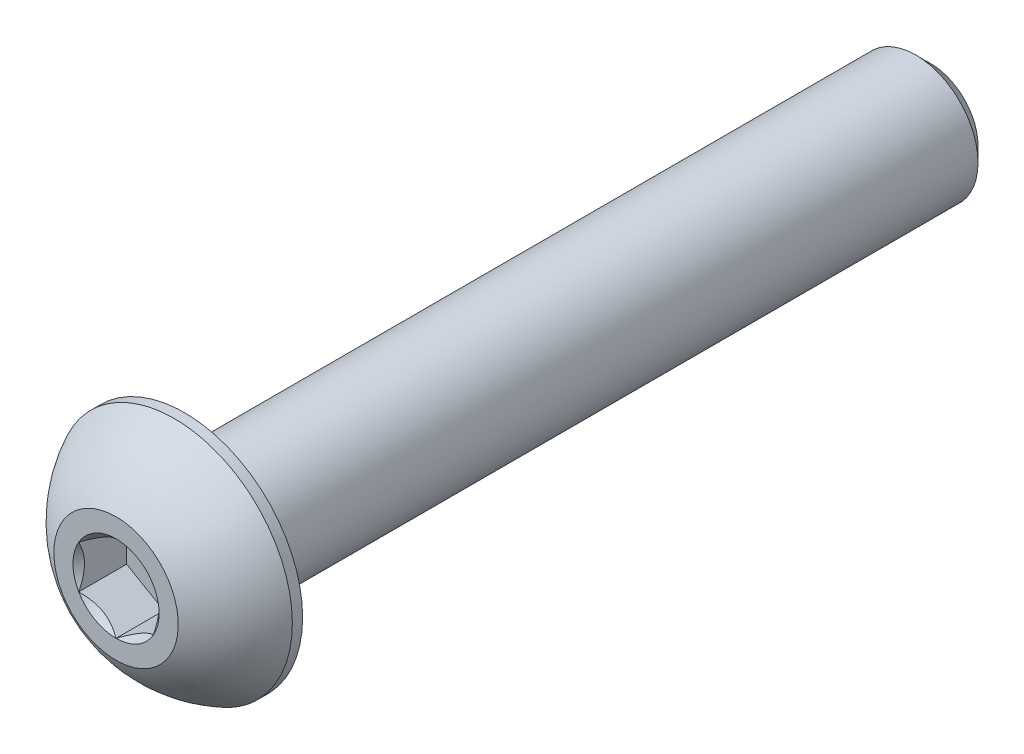
ISO-10303-21;
HEADER;
FILE_DESCRIPTION(('STEP AP214'),'2;1');
FILE_NAME('part.step','',(''),(''),'','','');
FILE_SCHEMA(('AUTOMOTIVE_DESIGN { 1 0 10303 214 1 1 1 1 }'));
ENDSEC;
DATA;
#1=APPLICATION_CONTEXT('core data for automotive mechanical design processes');
#2=APPLICATION_PROTOCOL_DEFINITION('international standard','automotive_design',2000,#1);
#3=PRODUCT_CONTEXT('',#1,'mechanical');
#4=PRODUCT('Part','Part','',(#3));
#5=PRODUCT_RELATED_PRODUCT_CATEGORY('part','',(#4));
#6=PRODUCT_DEFINITION_FORMATION('','',#4);
#7=PRODUCT_DEFINITION_CONTEXT('part definition',#1,'design');
#8=PRODUCT_DEFINITION('design','',#6,#7);
#9=PRODUCT_DEFINITION_SHAPE('','',#8);
#10=(LENGTH_UNIT() NAMED_UNIT(*) SI_UNIT(.MILLI.,.METRE.));
#11=(NAMED_UNIT(*) PLANE_ANGLE_UNIT() SI_UNIT($,.RADIAN.));
#12=(NAMED_UNIT(*) SI_UNIT($,.STERADIAN.) SOLID_ANGLE_UNIT());
#13=UNCERTAINTY_MEASURE_WITH_UNIT(LENGTH_MEASURE(1.E-05),#10,'distance_accuracy_value','');
#14=(GEOMETRIC_REPRESENTATION_CONTEXT(3) GLOBAL_UNCERTAINTY_ASSIGNED_CONTEXT((#13)) GLOBAL_UNIT_ASSIGNED_CONTEXT((#10,
#11,#12)) REPRESENTATION_CONTEXT('',''));
#15=CARTESIAN_POINT('',(0.,0.,0.));
#16=DIRECTION('',(0.,0.,1.));
#17=DIRECTION('',(1.,0.,0.));
#18=AXIS2_PLACEMENT_3D('',#15,#16,#17);
#19=CARTESIAN_POINT('',(1.5,-0.866025403784438,-1.925));
#20=DIRECTION('',(0.,0.,1.));
#21=DIRECTION('',(1.,0.,0.));
#22=AXIS2_PLACEMENT_3D('',#19,#20,#21);
#23=PLANE('',#22);
#24=DIRECTION('',(0.,1.,0.));
#25=VECTOR('',#24,1.);
#26=CARTESIAN_POINT('',(-1.5,0.866025403784438,-1.925));
#27=LINE('',#26,#25);
#28=CARTESIAN_POINT('',(-1.5,0.866025403784439,-1.925));
#29=VERTEX_POINT('',#28);
#30=CARTESIAN_POINT('',(-1.5,-0.866025403784439,-1.925));
#31=VERTEX_POINT('',#30);
#32=EDGE_CURVE('E67',#29,#31,#27,.F.);
#33=ORIENTED_EDGE('',*,*,#32,.T.);
#34=DIRECTION('',(0.866025403784439,-0.5,0.));
#35=VECTOR('',#34,1.);
#36=CARTESIAN_POINT('',(-1.5,-0.866025403784439,-1.925));
#37=LINE('',#36,#35);
#38=CARTESIAN_POINT('',(0.,-1.73205080756888,-1.925));
#39=VERTEX_POINT('',#38);
#40=EDGE_CURVE('E81',#31,#39,#37,.T.);
#41=ORIENTED_EDGE('',*,*,#40,.T.);
#42=DIRECTION('',(0.866025403784438,0.5,0.));
#43=VECTOR('',#42,1.);
#44=CARTESIAN_POINT('',(0.,-1.73205080756888,-1.925));
#45=LINE('',#44,#43);
#46=CARTESIAN_POINT('',(1.5,-0.866025403784439,-1.925));
#47=VERTEX_POINT('',#46);
#48=EDGE_CURVE('E84',#39,#47,#45,.T.);
#49=ORIENTED_EDGE('',*,*,#48,.T.);
#50=DIRECTION('',(0.,1.,0.));
#51=VECTOR('',#50,1.);
#52=CARTESIAN_POINT('',(1.5,-0.866025403784438,-1.925));
#53=LINE('',#52,#51);
#54=CARTESIAN_POINT('',(1.5,0.866025403784439,-1.925));
#55=VERTEX_POINT('',#54);
#56=EDGE_CURVE('E93',#47,#55,#53,.T.);
#57=ORIENTED_EDGE('',*,*,#56,.T.);
#58=DIRECTION('',(-0.866025403784439,0.5,0.));
#59=VECTOR('',#58,1.);
#60=CARTESIAN_POINT('',(1.5,0.866025403784439,-1.925));
#61=LINE('',#60,#59);
#62=CARTESIAN_POINT('',(0.,1.73205080756888,-1.925));
#63=VERTEX_POINT('',#62);
#64=EDGE_CURVE('E265',#55,#63,#61,.T.);
#65=ORIENTED_EDGE('',*,*,#64,.T.);
#66=DIRECTION('',(-0.866025403784438,-0.5,0.));
#67=VECTOR('',#66,1.);
#68=CARTESIAN_POINT('',(0.,1.73205080756888,-1.925));
#69=LINE('',#68,#67);
#70=EDGE_CURVE('E72',#63,#29,#69,.T.);
#71=ORIENTED_EDGE('',*,*,#70,.T.);
#72=EDGE_LOOP('',(#33,#41,#49,#57,#65,#71));
#73=FACE_BOUND('',#72,.T.);
#74=ADVANCED_FACE('F17',(#73),#23,.T.);
#75=CARTESIAN_POINT('',(-1.5,-0.866025403784439,-1.925));
#76=DIRECTION('',(-0.5,-0.866025403784439,0.));
#77=DIRECTION('',(0.866025403784439,-0.5,0.));
#78=AXIS2_PLACEMENT_3D('',#75,#76,#77);
#79=PLANE('',#78);
#80=CARTESIAN_POINT('',(-1.50000000002453,-0.866025403770048,-3.49730883349403E-11));
#81=CARTESIAN_POINT('',(-1.44844426727117,-0.895791119953617,-0.0297371504849993));
#82=CARTESIAN_POINT('',(-1.39602652187328,-0.926054519369461,-0.0577274997332096));
#83=CARTESIAN_POINT('',(-1.28914135977816,-0.9877646964775,-0.108976634295228));
#84=CARTESIAN_POINT('',(-1.23466378385068,-1.01921733960401,-0.132206913925155));
#85=CARTESIAN_POINT('',(-1.12481242363947,-1.08264005199279,-0.172000539063643));
#86=CARTESIAN_POINT('',(-1.06946660011449,-1.11459397810346,-0.188663877355987));
#87=CARTESIAN_POINT('',(-0.95755685533188,-1.17920509937865,-0.214336924391904));
#88=CARTESIAN_POINT('',(-0.900996350293105,-1.21186032218828,-0.223365789908325));
#89=CARTESIAN_POINT('',(-0.803509072843295,-1.26814462806649,-0.231512589340654));
#90=CARTESIAN_POINT('',(-0.762708138141556,-1.29170105869973,-0.232718117543908));
#91=CARTESIAN_POINT('',(-0.68117834074718,-1.33877230917235,-0.230683861819339));
#92=CARTESIAN_POINT('',(-0.640449495964758,-1.36228711867126,-0.22744309593466));
#93=CARTESIAN_POINT('',(-0.559384065201953,-1.40909026694414,-0.216702694706976));
#94=CARTESIAN_POINT('',(-0.51904787950441,-1.4323783746147,-0.20919909909419));
#95=CARTESIAN_POINT('',(-0.439052551258332,-1.47856369891149,-0.19034052638936));
#96=CARTESIAN_POINT('',(-0.399393706909126,-1.50146074337225,-0.178983896683506));
#97=CARTESIAN_POINT('',(-0.297850129661508,-1.56008695503064,-0.145281418581615));
#98=CARTESIAN_POINT('',(-0.236594120185608,-1.59545312859103,-0.120399016466317));
#99=CARTESIAN_POINT('',(-0.146523888893023,-1.64745520087378,-0.0783962697862533));
#100=CARTESIAN_POINT('',(-0.116842951449675,-1.6645914980965,-0.0636393457173694));
#101=CARTESIAN_POINT('',(-0.0580266310224323,-1.69854911652791,-0.0327784720806824));
#102=CARTESIAN_POINT('',(-0.0288909964375011,-1.71537058299853,-0.0166751634684283));
#103=CARTESIAN_POINT('',(2.46562120663875E-11,-1.73205080758311,-3.5066995750627E-11));
#104=B_SPLINE_CURVE_WITH_KNOTS('',3,(#80,#81,#82,#83,#84,#85,#86,#87,#88,#89,#90,#91,#92,#93,
#94,#95,#96,#97,#98,#99,#100,#101,#102,#103),.UNSPECIFIED.,.F.,.F.,(4,2,2,2,2,2,2,2,2,2,2,4),
(0.,0.199774419910088,0.4007123122777,0.598459990337994,0.795709985707602,0.936894690871223,
1.07811058146816,1.21945788001607,1.36086588096647,1.58533909988034,1.69726364731887,
1.80913521242832),.UNSPECIFIED.);
#105=CARTESIAN_POINT('',(-1.50000000002135,-0.866025403796764,-2.4651077774769E-11));
#106=VERTEX_POINT('',#105);
#107=CARTESIAN_POINT('',(-3.03592605946672E-11,-1.73205080760065,-1.75295343369276E-11));
#108=VERTEX_POINT('',#107);
#109=EDGE_CURVE('E20',#106,#108,#104,.T.);
#110=ORIENTED_EDGE('',*,*,#109,.T.);
#111=DIRECTION('',(0.,0.,1.));
#112=VECTOR('',#111,1.);
#113=CARTESIAN_POINT('',(0.,-1.73205080756888,-1.925));
#114=LINE('',#113,#112);
#115=EDGE_CURVE('E88',#108,#39,#114,.F.);
#116=ORIENTED_EDGE('',*,*,#115,.T.);
#117=ORIENTED_EDGE('',*,*,#40,.F.);
#118=DIRECTION('',(0.,0.,1.));
#119=VECTOR('',#118,1.);
#120=CARTESIAN_POINT('',(-1.5,-0.866025403784439,-1.925));
#121=LINE('',#120,#119);
#122=EDGE_CURVE('E59',#31,#106,#121,.T.);
#123=ORIENTED_EDGE('',*,*,#122,.T.);
#124=EDGE_LOOP('',(#110,#116,#117,#123));
#125=FACE_BOUND('',#124,.T.);
#126=ADVANCED_FACE('F89',(#125),#79,.F.);
#127=CARTESIAN_POINT('',(0.,-1.73205080756888,-1.925));
#128=DIRECTION('',(0.5,-0.866025403784438,0.));
#129=DIRECTION('',(0.866025403784438,0.5,0.));
#130=AXIS2_PLACEMENT_3D('',#127,#128,#129);
#131=PLANE('',#130);
#132=CARTESIAN_POINT('',(-2.47283241622989E-11,-1.73205080758293,-3.49712886177983E-11));
#133=CARTESIAN_POINT('',(0.0515557327287634,-1.70228509139958,-0.0297371504849972));
#134=CARTESIAN_POINT('',(0.103973478126704,-1.67202169198382,-0.0577274997332075));
#135=CARTESIAN_POINT('',(0.210858640221864,-1.61031151487585,-0.108976634295226));
#136=CARTESIAN_POINT('',(0.265336216149329,-1.57885887174931,-0.132206913925153));
#137=CARTESIAN_POINT('',(0.375187576360524,-1.51543615936052,-0.172000539063641));
#138=CARTESIAN_POINT('',(0.430533399885509,-1.48348223324986,-0.188663877355984));
#139=CARTESIAN_POINT('',(0.542443144668122,-1.41887111197467,-0.214336924391901));
#140=CARTESIAN_POINT('',(0.599003649706896,-1.38621588916504,-0.223365789908323));
#141=CARTESIAN_POINT('',(0.696490927156706,-1.32993158328682,-0.231512589340651));
#142=CARTESIAN_POINT('',(0.737291861858445,-1.30637515265359,-0.232718117543906));
#143=CARTESIAN_POINT('',(0.818821659252821,-1.25930390218097,-0.230683861819337));
#144=CARTESIAN_POINT('',(0.859550504035243,-1.23578909268205,-0.227443095934658));
#145=CARTESIAN_POINT('',(0.940615934798048,-1.18898594440918,-0.216702694706974));
#146=CARTESIAN_POINT('',(0.980952120495591,-1.16569783673862,-0.209199099094188));
#147=CARTESIAN_POINT('',(1.06094744874167,-1.11951251244183,-0.190340526389358));
#148=CARTESIAN_POINT('',(1.10060629309087,-1.09661546798107,-0.178983896683504));
#149=CARTESIAN_POINT('',(1.20214987033849,-1.03798925632268,-0.145281418581614));
#150=CARTESIAN_POINT('',(1.26340587981439,-1.00262308276228,-0.120399016466316));
#151=CARTESIAN_POINT('',(1.35347611110698,-0.950621010479539,-0.0783962697862523));
#152=CARTESIAN_POINT('',(1.38315704855032,-0.933484713256822,-0.0636393457173685));
#153=CARTESIAN_POINT('',(1.44197336897757,-0.89952709482541,-0.0327784720806818));
#154=CARTESIAN_POINT('',(1.4711090035625,-0.882705628354789,-0.0166751634684277));
#155=CARTESIAN_POINT('',(1.50000000002466,-0.866025403770206,-3.50662371950392E-11));
#156=B_SPLINE_CURVE_WITH_KNOTS('',3,(#132,#133,#134,#135,#136,#137,#138,#139,#140,#141,#142,
#143,#144,#145,#146,#147,#148,#149,#150,#151,#152,#153,#154,#155),.UNSPECIFIED.,.F.,.F.,(4,2,2,
2,2,2,2,2,2,2,2,4),(0.,0.199774419910088,0.400712312277699,0.598459990337993,0.795709985707601,
0.936894690871222,1.07811058146816,1.21945788001607,1.36086588096647,1.58533909988034,
1.69726364731887,1.80913521242832),.UNSPECIFIED.);
#157=CARTESIAN_POINT('',(1.50000000001233,-0.866025403826621,-1.7529131224469E-11));
#158=VERTEX_POINT('',#157);
#159=EDGE_CURVE('E202',#108,#158,#156,.T.);
#160=ORIENTED_EDGE('',*,*,#159,.T.);
#161=DIRECTION('',(0.,0.,-1.));
#162=VECTOR('',#161,1.);
#163=CARTESIAN_POINT('',(1.5,-0.866025403784439,-1.925));
#164=LINE('',#163,#162);
#165=EDGE_CURVE('E97',#158,#47,#164,.T.);
#166=ORIENTED_EDGE('',*,*,#165,.T.);
#167=ORIENTED_EDGE('',*,*,#48,.F.);
#168=ORIENTED_EDGE('',*,*,#115,.F.);
#169=EDGE_LOOP('',(#160,#166,#167,#168));
#170=FACE_BOUND('',#169,.T.);
#171=ADVANCED_FACE('F95',(#170),#131,.F.);
#172=CARTESIAN_POINT('',(1.5,-0.866025403784438,-1.925));
#173=DIRECTION('',(1.,0.,0.));
#174=DIRECTION('',(0.,0.,-1.));
#175=AXIS2_PLACEMENT_3D('',#172,#173,#174);
#176=PLANE('',#175);
#177=CARTESIAN_POINT('',(1.4999999999998,-0.866025403812882,-3.49731948477309E-11));
#178=CARTESIAN_POINT('',(1.49999999999993,-0.806493971458483,-0.0297371504859726));
#179=CARTESIAN_POINT('',(1.49999999999998,-0.745967172639481,-0.0577274997356718));
#180=CARTESIAN_POINT('',(1.50000000000002,-0.622546818448653,-0.108976634302055));
#181=CARTESIAN_POINT('',(1.50000000000001,-0.559641532208188,-0.132206913934862));
#182=CARTESIAN_POINT('',(1.5,-0.432796107455125,-0.172000539080811));
#183=CARTESIAN_POINT('',(1.5,-0.368888255245699,-0.188663877377684));
#184=CARTESIAN_POINT('',(1.5,-0.239666012718551,-0.214336924424236));
#185=CARTESIAN_POINT('',(1.5,-0.174355567110582,-0.223365789946761));
#186=CARTESIAN_POINT('',(1.5,-0.0617869553803679,-0.231512589389946));
#187=CARTESIAN_POINT('',(1.5,-0.0146740941290628,-0.232718117598397));
#188=CARTESIAN_POINT('',(1.5,0.0794684067864031,-0.230683861885897));
#189=CARTESIAN_POINT('',(1.5,0.126498025769629,-0.227443096008093));
#190=CARTESIAN_POINT('',(1.5,0.22010432228685,-0.21670269479537));
#191=CARTESIAN_POINT('',(1.5,0.266680537614034,-0.209199099190673));
#192=CARTESIAN_POINT('',(1.5,0.359051186180354,-0.190340526502742));
#193=CARTESIAN_POINT('',(1.5,0.404845275088565,-0.178983896805698));
#194=CARTESIAN_POINT('',(1.5,0.522097698449399,-0.145281418704612));
#195=CARTESIAN_POINT('',(1.5,0.592830045625335,-0.120399016572433));
#196=CARTESIAN_POINT('',(1.5,0.69683419026976,-0.0783962698582894));
#197=CARTESIAN_POINT('',(1.5,0.731106784740956,-0.0636393457765502));
#198=CARTESIAN_POINT('',(1.5,0.799022021654026,-0.0327784721118594));
#199=CARTESIAN_POINT('',(1.5,0.832664954619755,-0.0166751634844621));
#200=CARTESIAN_POINT('',(1.5,0.866025403812908,-3.5067301240063E-11));
#201=B_SPLINE_CURVE_WITH_KNOTS('',3,(#177,#178,#179,#180,#181,#182,#183,#184,#185,#186,#187,
#188,#189,#190,#191,#192,#193,#194,#195,#196,#197,#198,#199,#200),.UNSPECIFIED.,.F.,.F.,(4,2,2,
2,2,2,2,2,2,2,2,4),(0.,0.199774419877746,0.400712312213007,0.598459990242251,0.795709985580833,
0.936894690699465,1.07811058125136,1.21945787975417,1.36086588065946,1.58533909974464,
1.69726364726936,1.80913521246463),.UNSPECIFIED.);
#202=CARTESIAN_POINT('',(1.5000000000427,0.866025403774031,-1.75296331798823E-11));
#203=VERTEX_POINT('',#202);
#204=EDGE_CURVE('E184',#158,#203,#201,.T.);
#205=ORIENTED_EDGE('',*,*,#204,.T.);
#206=DIRECTION('',(0.,0.,1.));
#207=VECTOR('',#206,1.);
#208=CARTESIAN_POINT('',(1.5,0.866025403784439,-1.925));
#209=LINE('',#208,#207);
#210=EDGE_CURVE('E262',#203,#55,#209,.F.);
#211=ORIENTED_EDGE('',*,*,#210,.T.);
#212=ORIENTED_EDGE('',*,*,#56,.F.);
#213=ORIENTED_EDGE('',*,*,#165,.F.);
#214=EDGE_LOOP('',(#205,#211,#212,#213));
#215=FACE_BOUND('',#214,.T.);
#216=ADVANCED_FACE('F174',(#215),#176,.F.);
#217=CARTESIAN_POINT('',(1.5,0.866025403784439,-1.925));
#218=DIRECTION('',(0.5,0.866025403784439,0.));
#219=DIRECTION('',(-0.866025403784439,0.5,0.));
#220=AXIS2_PLACEMENT_3D('',#217,#218,#219);
#221=PLANE('',#220);
#222=CARTESIAN_POINT('',(1.50000000002453,0.866025403770048,-3.4973253111955E-11));
#223=CARTESIAN_POINT('',(1.44844426727117,0.895791119953617,-0.0297371504849994));
#224=CARTESIAN_POINT('',(1.39602652187328,0.926054519369461,-0.0577274997332097));
#225=CARTESIAN_POINT('',(1.28914135977816,0.987764696477501,-0.108976634295228));
#226=CARTESIAN_POINT('',(1.23466378385068,1.01921733960401,-0.132206913925155));
#227=CARTESIAN_POINT('',(1.12481242363947,1.08264005199279,-0.172000539063643));
#228=CARTESIAN_POINT('',(1.06946660011449,1.11459397810346,-0.188663877355987));
#229=CARTESIAN_POINT('',(0.95755685533188,1.17920509937865,-0.214336924391904));
#230=CARTESIAN_POINT('',(0.900996350293104,1.21186032218828,-0.223365789908325));
#231=CARTESIAN_POINT('',(0.803509072843295,1.26814462806649,-0.231512589340654));
#232=CARTESIAN_POINT('',(0.762708138141556,1.29170105869973,-0.232718117543908));
#233=CARTESIAN_POINT('',(0.68117834074718,1.33877230917235,-0.230683861819339));
#234=CARTESIAN_POINT('',(0.640449495964758,1.36228711867126,-0.22744309593466));
#235=CARTESIAN_POINT('',(0.559384065201953,1.40909026694414,-0.216702694706976));
#236=CARTESIAN_POINT('',(0.51904787950441,1.4323783746147,-0.20919909909419));
#237=CARTESIAN_POINT('',(0.439052551258333,1.47856369891149,-0.19034052638936));
#238=CARTESIAN_POINT('',(0.399393706909126,1.50146074337225,-0.178983896683506));
#239=CARTESIAN_POINT('',(0.297850129661507,1.56008695503064,-0.145281418581616));
#240=CARTESIAN_POINT('',(0.236594120185608,1.59545312859103,-0.120399016466317));
#241=CARTESIAN_POINT('',(0.146523888893023,1.64745520087378,-0.0783962697862531));
#242=CARTESIAN_POINT('',(0.116842951449674,1.6645914980965,-0.0636393457173692));
#243=CARTESIAN_POINT('',(0.0580266310224316,1.69854911652791,-0.0327784720806821));
#244=CARTESIAN_POINT('',(0.0288909964375004,1.71537058299853,-0.0166751634684281));
#245=CARTESIAN_POINT('',(-2.46568834570738E-11,1.73205080758311,-3.50665978158375E-11));
#246=B_SPLINE_CURVE_WITH_KNOTS('',3,(#222,#223,#224,#225,#226,#227,#228,#229,#230,#231,#232,
#233,#234,#235,#236,#237,#238,#239,#240,#241,#242,#243,#244,#245),.UNSPECIFIED.,.F.,.F.,(4,2,2,
2,2,2,2,2,2,2,2,4),(0.,0.199774419910088,0.400712312277699,0.598459990337994,0.795709985707602,
0.936894690871222,1.07811058146816,1.21945788001607,1.36086588096647,1.58533909988034,
1.69726364731887,1.80913521242832),.UNSPECIFIED.);
#247=CARTESIAN_POINT('',(3.03590397906963E-11,1.73205080760065,-1.75294164449582E-11));
#248=VERTEX_POINT('',#247);
#249=EDGE_CURVE('E178',#203,#248,#246,.T.);
#250=ORIENTED_EDGE('',*,*,#249,.T.);
#251=DIRECTION('',(0.,0.,1.));
#252=VECTOR('',#251,1.);
#253=CARTESIAN_POINT('',(0.,1.73205080756888,-1.925));
#254=LINE('',#253,#252);
#255=EDGE_CURVE('E257',#248,#63,#254,.F.);
#256=ORIENTED_EDGE('',*,*,#255,.T.);
#257=ORIENTED_EDGE('',*,*,#64,.F.);
#258=ORIENTED_EDGE('',*,*,#210,.F.);
#259=EDGE_LOOP('',(#250,#256,#257,#258));
#260=FACE_BOUND('',#259,.T.);
#261=ADVANCED_FACE('F170',(#260),#221,.F.);
#262=CARTESIAN_POINT('',(0.,1.73205080756888,-1.925));
#263=DIRECTION('',(-0.5,0.866025403784438,0.));
#264=DIRECTION('',(-0.866025403784438,-0.5,0.));
#265=AXIS2_PLACEMENT_3D('',#262,#263,#264);
#266=PLANE('',#265);
#267=CARTESIAN_POINT('',(2.47278634993487E-11,1.73205080758293,-3.49716904690521E-11));
#268=CARTESIAN_POINT('',(-0.0515557327287638,1.70228509139958,-0.0297371504849977));
#269=CARTESIAN_POINT('',(-0.103973478126705,1.67202169198382,-0.0577274997332079));
#270=CARTESIAN_POINT('',(-0.210858640221864,1.61031151487585,-0.108976634295226));
#271=CARTESIAN_POINT('',(-0.26533621614933,1.57885887174931,-0.132206913925153));
#272=CARTESIAN_POINT('',(-0.375187576360525,1.51543615936052,-0.172000539063641));
#273=CARTESIAN_POINT('',(-0.430533399885509,1.48348223324986,-0.188663877355985));
#274=CARTESIAN_POINT('',(-0.542443144668123,1.41887111197467,-0.214336924391901));
#275=CARTESIAN_POINT('',(-0.599003649706897,1.38621588916504,-0.223365789908323));
#276=CARTESIAN_POINT('',(-0.696490927156706,1.32993158328682,-0.231512589340651));
#277=CARTESIAN_POINT('',(-0.737291861858445,1.30637515265359,-0.232718117543906));
#278=CARTESIAN_POINT('',(-0.818821659252822,1.25930390218097,-0.230683861819337));
#279=CARTESIAN_POINT('',(-0.859550504035244,1.23578909268205,-0.227443095934658));
#280=CARTESIAN_POINT('',(-0.940615934798048,1.18898594440918,-0.216702694706974));
#281=CARTESIAN_POINT('',(-0.980952120495591,1.16569783673862,-0.209199099094188));
#282=CARTESIAN_POINT('',(-1.06094744874167,1.11951251244183,-0.190340526389358));
#283=CARTESIAN_POINT('',(-1.10060629309088,1.09661546798107,-0.178983896683504));
#284=CARTESIAN_POINT('',(-1.20214987033849,1.03798925632268,-0.145281418581613));
#285=CARTESIAN_POINT('',(-1.26340587981439,1.00262308276228,-0.120399016466315));
#286=CARTESIAN_POINT('',(-1.35347611110698,0.950621010479539,-0.0783962697862516));
#287=CARTESIAN_POINT('',(-1.38315704855033,0.933484713256821,-0.0636393457173678));
#288=CARTESIAN_POINT('',(-1.44197336897757,0.899527094825409,-0.0327784720806811));
#289=CARTESIAN_POINT('',(-1.4711090035625,0.882705628354789,-0.0166751634684272));
#290=CARTESIAN_POINT('',(-1.50000000002466,0.866025403770206,-3.50659196153753E-11));
#291=B_SPLINE_CURVE_WITH_KNOTS('',3,(#267,#268,#269,#270,#271,#272,#273,#274,#275,#276,#277,
#278,#279,#280,#281,#282,#283,#284,#285,#286,#287,#288,#289,#290),.UNSPECIFIED.,.F.,.F.,(4,2,2,
2,2,2,2,2,2,2,2,4),(0.,0.199774419910088,0.400712312277699,0.598459990337993,0.795709985707601,
0.936894690871222,1.07811058146816,1.21945788001607,1.36086588096647,1.58533909988034,
1.69726364731887,1.80913521242832),.UNSPECIFIED.);
#292=CARTESIAN_POINT('',(-1.50000000001233,0.86602540382662,-1.75290210342841E-11));
#293=VERTEX_POINT('',#292);
#294=EDGE_CURVE('E40',#248,#293,#291,.T.);
#295=ORIENTED_EDGE('',*,*,#294,.T.);
#296=DIRECTION('',(0.,0.,1.));
#297=VECTOR('',#296,1.);
#298=CARTESIAN_POINT('',(-1.5,0.866025403784438,-1.925));
#299=LINE('',#298,#297);
#300=EDGE_CURVE('E250',#293,#29,#299,.F.);
#301=ORIENTED_EDGE('',*,*,#300,.T.);
#302=ORIENTED_EDGE('',*,*,#70,.F.);
#303=ORIENTED_EDGE('',*,*,#255,.F.);
#304=EDGE_LOOP('',(#295,#301,#302,#303));
#305=FACE_BOUND('',#304,.T.);
#306=ADVANCED_FACE('F163',(#305),#266,.F.);
#307=CARTESIAN_POINT('',(-1.5,0.866025403784438,-1.925));
#308=DIRECTION('',(-1.,0.,0.));
#309=DIRECTION('',(0.,0.,1.));
#310=AXIS2_PLACEMENT_3D('',#307,#308,#309);
#311=PLANE('',#310);
#312=CARTESIAN_POINT('',(-1.4999999999998,0.866025403812881,-3.49736894377255E-11));
#313=CARTESIAN_POINT('',(-1.49999999999993,0.806493971458482,-0.0297371504859727));
#314=CARTESIAN_POINT('',(-1.49999999999998,0.74596717263948,-0.0577274997356719));
#315=CARTESIAN_POINT('',(-1.50000000000002,0.622546818448652,-0.108976634302056));
#316=CARTESIAN_POINT('',(-1.50000000000001,0.559641532208187,-0.132206913934863));
#317=CARTESIAN_POINT('',(-1.5,0.432796107455124,-0.172000539080812));
#318=CARTESIAN_POINT('',(-1.5,0.368888255245698,-0.188663877377684));
#319=CARTESIAN_POINT('',(-1.5,0.23966601271855,-0.214336924424236));
#320=CARTESIAN_POINT('',(-1.5,0.174355567110582,-0.223365789946761));
#321=CARTESIAN_POINT('',(-1.5,0.0617869553803675,-0.231512589389946));
#322=CARTESIAN_POINT('',(-1.5,0.0146740941290625,-0.232718117598397));
#323=CARTESIAN_POINT('',(-1.5,-0.0794684067864032,-0.230683861885897));
#324=CARTESIAN_POINT('',(-1.5,-0.126498025769629,-0.227443096008093));
#325=CARTESIAN_POINT('',(-1.5,-0.22010432228685,-0.21670269479537));
#326=CARTESIAN_POINT('',(-1.5,-0.266680537614034,-0.209199099190673));
#327=CARTESIAN_POINT('',(-1.5,-0.359051186180354,-0.190340526502742));
#328=CARTESIAN_POINT('',(-1.5,-0.404845275088566,-0.178983896805698));
#329=CARTESIAN_POINT('',(-1.5,-0.522097698449399,-0.145281418704612));
#330=CARTESIAN_POINT('',(-1.5,-0.592830045625335,-0.120399016572433));
#331=CARTESIAN_POINT('',(-1.5,-0.69683419026976,-0.0783962698582894));
#332=CARTESIAN_POINT('',(-1.5,-0.731106784740956,-0.0636393457765503));
#333=CARTESIAN_POINT('',(-1.5,-0.799022021654026,-0.0327784721118596));
#334=CARTESIAN_POINT('',(-1.5,-0.832664954619755,-0.0166751634844622));
#335=CARTESIAN_POINT('',(-1.5,-0.866025403812908,-3.50673251714009E-11));
#336=B_SPLINE_CURVE_WITH_KNOTS('',3,(#312,#313,#314,#315,#316,#317,#318,#319,#320,#321,#322,
#323,#324,#325,#326,#327,#328,#329,#330,#331,#332,#333,#334,#335),.UNSPECIFIED.,.F.,.F.,(4,2,2,
2,2,2,2,2,2,2,2,4),(0.,0.199774419877746,0.400712312213007,0.598459990242251,0.795709985580833,
0.936894690699464,1.07811058125136,1.21945787975417,1.36086588065945,1.58533909974464,
1.69726364726936,1.80913521246463),.UNSPECIFIED.);
#337=EDGE_CURVE('E143',#293,#106,#336,.T.);
#338=ORIENTED_EDGE('',*,*,#337,.T.);
#339=ORIENTED_EDGE('',*,*,#122,.F.);
#340=ORIENTED_EDGE('',*,*,#32,.F.);
#341=ORIENTED_EDGE('',*,*,#300,.F.);
#342=EDGE_LOOP('',(#338,#339,#340,#341));
#343=FACE_BOUND('',#342,.T.);
#344=ADVANCED_FACE('F159',(#343),#311,.F.);
#345=CARTESIAN_POINT('',(0.,0.,0.));
#346=DIRECTION('',(0.,0.,1.));
#347=DIRECTION('',(1.,0.,0.));
#348=AXIS2_PLACEMENT_3D('',#345,#346,#347);
#349=CONICAL_SURFACE('',#348,1.73205080761818,0.785398163519197);
#350=ORIENTED_EDGE('',*,*,#109,.F.);
#351=CARTESIAN_POINT('',(0.,0.,0.));
#352=DIRECTION('',(0.,0.,1.));
#353=DIRECTION('',(1.,0.,0.));
#354=AXIS2_PLACEMENT_3D('',#351,#352,#353);
#355=CIRCLE('',#354,1.73205080761818);
#356=EDGE_CURVE('E151',#106,#108,#355,.T.);
#357=ORIENTED_EDGE('',*,*,#356,.T.);
#358=EDGE_LOOP('',(#350,#357));
#359=FACE_BOUND('',#358,.T.);
#360=ADVANCED_FACE('F162',(#359),#349,.F.);
#361=CARTESIAN_POINT('',(0.,0.,0.));
#362=DIRECTION('',(0.,0.,1.));
#363=DIRECTION('',(1.,0.,0.));
#364=AXIS2_PLACEMENT_3D('',#361,#362,#363);
#365=CONICAL_SURFACE('',#364,1.73205080761818,0.785398163519197);
#366=ORIENTED_EDGE('',*,*,#159,.F.);
#367=CARTESIAN_POINT('',(0.,0.,0.));
#368=DIRECTION('',(0.,0.,1.));
#369=DIRECTION('',(1.,0.,0.));
#370=AXIS2_PLACEMENT_3D('',#367,#368,#369);
#371=CIRCLE('',#370,1.73205080761818);
#372=EDGE_CURVE('E303',#108,#158,#371,.T.);
#373=ORIENTED_EDGE('',*,*,#372,.T.);
#374=EDGE_LOOP('',(#366,#373));
#375=FACE_BOUND('',#374,.T.);
#376=ADVANCED_FACE('F197',(#375),#365,.F.);
#377=CARTESIAN_POINT('',(0.,0.,0.));
#378=DIRECTION('',(0.,0.,1.));
#379=DIRECTION('',(1.,0.,0.));
#380=AXIS2_PLACEMENT_3D('',#377,#378,#379);
#381=CONICAL_SURFACE('',#380,1.73205080761818,0.785398163397448);
#382=CARTESIAN_POINT('',(0.,0.,0.));
#383=DIRECTION('',(0.,0.,1.));
#384=DIRECTION('',(1.,0.,0.));
#385=AXIS2_PLACEMENT_3D('',#382,#383,#384);
#386=CIRCLE('',#385,1.73205080761818);
#387=EDGE_CURVE('E304',#158,#203,#386,.T.);
#388=ORIENTED_EDGE('',*,*,#387,.T.);
#389=ORIENTED_EDGE('',*,*,#204,.F.);
#390=EDGE_LOOP('',(#388,#389));
#391=FACE_BOUND('',#390,.T.);
#392=ADVANCED_FACE('F193',(#391),#381,.F.);
#393=CARTESIAN_POINT('',(0.,0.,0.));
#394=DIRECTION('',(0.,0.,1.));
#395=DIRECTION('',(1.,0.,0.));
#396=AXIS2_PLACEMENT_3D('',#393,#394,#395);
#397=CONICAL_SURFACE('',#396,1.73205080761818,0.785398163519197);
#398=ORIENTED_EDGE('',*,*,#249,.F.);
#399=CARTESIAN_POINT('',(0.,0.,0.));
#400=DIRECTION('',(0.,0.,1.));
#401=DIRECTION('',(1.,0.,0.));
#402=AXIS2_PLACEMENT_3D('',#399,#400,#401);
#403=CIRCLE('',#402,1.73205080761818);
#404=EDGE_CURVE('E305',#203,#248,#403,.T.);
#405=ORIENTED_EDGE('',*,*,#404,.T.);
#406=EDGE_LOOP('',(#398,#405));
#407=FACE_BOUND('',#406,.T.);
#408=ADVANCED_FACE('F190',(#407),#397,.F.);
#409=CARTESIAN_POINT('',(0.,0.,0.));
#410=DIRECTION('',(0.,0.,1.));
#411=DIRECTION('',(1.,0.,0.));
#412=AXIS2_PLACEMENT_3D('',#409,#410,#411);
#413=CONICAL_SURFACE('',#412,1.73205080761818,0.785398163519197);
#414=ORIENTED_EDGE('',*,*,#294,.F.);
#415=CARTESIAN_POINT('',(0.,0.,0.));
#416=DIRECTION('',(0.,0.,1.));
#417=DIRECTION('',(1.,0.,0.));
#418=AXIS2_PLACEMENT_3D('',#415,#416,#417);
#419=CIRCLE('',#418,1.73205080761818);
#420=EDGE_CURVE('E298',#248,#293,#419,.T.);
#421=ORIENTED_EDGE('',*,*,#420,.T.);
#422=EDGE_LOOP('',(#414,#421));
#423=FACE_BOUND('',#422,.T.);
#424=ADVANCED_FACE('F138',(#423),#413,.F.);
#425=CARTESIAN_POINT('',(0.,0.,0.));
#426=DIRECTION('',(0.,0.,1.));
#427=DIRECTION('',(1.,0.,0.));
#428=AXIS2_PLACEMENT_3D('',#425,#426,#427);
#429=CONICAL_SURFACE('',#428,1.73205080761818,0.785398163397448);
#430=ORIENTED_EDGE('',*,*,#337,.F.);
#431=CARTESIAN_POINT('',(0.,0.,0.));
#432=DIRECTION('',(0.,0.,1.));
#433=DIRECTION('',(1.,0.,0.));
#434=AXIS2_PLACEMENT_3D('',#431,#432,#433);
#435=CIRCLE('',#434,1.73205080761818);
#436=EDGE_CURVE('E123',#293,#106,#435,.T.);
#437=ORIENTED_EDGE('',*,*,#436,.T.);
#438=EDGE_LOOP('',(#430,#437));
#439=FACE_BOUND('',#438,.T.);
#440=ADVANCED_FACE('F133',(#439),#429,.F.);
#441=CARTESIAN_POINT('',(0.,-2.5,0.));
#442=DIRECTION('',(0.,0.,-1.));
#443=DIRECTION('',(-1.,0.,0.));
#444=AXIS2_PLACEMENT_3D('',#441,#442,#443);
#445=PLANE('',#444);
#446=ORIENTED_EDGE('',*,*,#420,.F.);
#447=ORIENTED_EDGE('',*,*,#404,.F.);
#448=ORIENTED_EDGE('',*,*,#387,.F.);
#449=ORIENTED_EDGE('',*,*,#372,.F.);
#450=ORIENTED_EDGE('',*,*,#356,.F.);
#451=ORIENTED_EDGE('',*,*,#436,.F.);
#452=EDGE_LOOP('',(#446,#447,#448,#449,#450,#451));
#453=FACE_BOUND('',#452,.T.);
#454=CARTESIAN_POINT('',(0.,2.5,0.));
#455=CARTESIAN_POINT('',(-0.140426104916171,2.49999377288615,0.));
#456=CARTESIAN_POINT('',(-0.280954031991962,2.48812860484106,3.15786606079497E-13));
#457=CARTESIAN_POINT('',(-0.558139658492382,2.44096074902969,-3.16166902160035E-13));
#458=CARTESIAN_POINT('',(-0.694792493265144,2.40562985309161,-1.1991938830655E-12));
#459=CARTESIAN_POINT('',(-0.960172122561447,2.31253633023374,-1.20166281841789E-12));
#460=CARTESIAN_POINT('',(-1.08890266852496,2.25478441650809,-3.21946211567848E-13));
#461=CARTESIAN_POINT('',(-1.33480476215494,2.11850293856874,3.21866212850881E-13));
#462=CARTESIAN_POINT('',(-1.45197917410753,2.03997854084975,0.));
#463=CARTESIAN_POINT('',(-1.67149637287936,1.86436525899232,0.));
#464=CARTESIAN_POINT('',(-1.77383760642256,1.76727443311113,0.));
#465=CARTESIAN_POINT('',(-1.96077108972063,1.5572853703438,0.));
#466=CARTESIAN_POINT('',(-2.04536264247664,1.44438651299413,0.));
#467=CARTESIAN_POINT('',(-2.19438926048053,1.20599153577204,0.));
#468=CARTESIAN_POINT('',(-2.2588247010994,1.08049565055392,0.));
#469=CARTESIAN_POINT('',(-2.36571190425968,0.820467575206641,0.));
#470=CARTESIAN_POINT('',(-2.40816371100576,0.685935403248265,0.));
#471=CARTESIAN_POINT('',(-2.46987884513361,0.41165323576608,0.));
#472=CARTESIAN_POINT('',(-2.4891421283097,0.271903230295725,0.));
#473=CARTESIAN_POINT('',(-2.50393321907299,-0.00884700938585766,0.));
#474=CARTESIAN_POINT('',(-2.49946106942909,-0.149847241343845,0.));
#475=CARTESIAN_POINT('',(-2.46690834048228,-0.429095661105703,0.));
#476=CARTESIAN_POINT('',(-2.43882775236998,-0.567343847882638,0.));
#477=CARTESIAN_POINT('',(-2.35985521676827,-0.837163810231991,0.));
#478=CARTESIAN_POINT('',(-2.30896324519902,-0.968735578756573,0.));
#479=CARTESIAN_POINT('',(-2.1858126315262,-1.2214675666181,0.));
#480=CARTESIAN_POINT('',(-2.11355399637579,-1.34262778934316,0.));
#481=CARTESIAN_POINT('',(-1.94972129370707,-1.57109730355804,0.));
#482=CARTESIAN_POINT('',(-1.85814723400701,-1.67840660065422,0.));
#483=CARTESIAN_POINT('',(-1.65828316813495,-1.87612814061528,0.));
#484=CARTESIAN_POINT('',(-1.54999315967219,-1.96654038116456,0.));
#485=CARTESIAN_POINT('',(-1.31977122488187,-2.12790126296045,0.));
#486=CARTESIAN_POINT('',(-1.19783929677156,-2.1988499016635,0.));
#487=CARTESIAN_POINT('',(-0.943794829063063,-2.31926953799949,0.));
#488=CARTESIAN_POINT('',(-0.811682289900767,-2.36874053655201,0.));
#489=CARTESIAN_POINT('',(-0.541026888337529,-2.44480055905629,0.));
#490=CARTESIAN_POINT('',(-0.402484026226278,-2.47138958403888,0.));
#491=CARTESIAN_POINT('',(-0.122900797575727,-2.50093087897621,0.));
#492=CARTESIAN_POINT('',(0.018139568963571,-2.50388314893098,3.46961945081868E-13));
#493=CARTESIAN_POINT('',(0.298714091660324,-2.48606712714886,-3.46961960712715E-13));
#494=CARTESIAN_POINT('',(0.438248247749923,-2.46529883434335,-1.29477243391078E-12));
#495=CARTESIAN_POINT('',(0.71184938433979,-2.40063123468837,-1.13730987603765E-12));
#496=CARTESIAN_POINT('',(0.845916364605969,-2.3567319268485,0.));
#497=CARTESIAN_POINT('',(1.10477735834655,-2.24704847617179,0.));
#498=CARTESIAN_POINT('',(1.22957137303277,-2.18126433619494,-1.00916257566668E-12));
#499=CARTESIAN_POINT('',(1.46634390401786,-2.02967864834023,-1.18352788602047E-12));
#500=CARTESIAN_POINT('',(1.57832242207297,-1.94387710320556,-3.16694129312418E-13));
#501=CARTESIAN_POINT('',(1.7862852822064,-1.7546922142879,3.16694257499622E-13));
#502=CARTESIAN_POINT('',(1.8822696178108,-1.6513088633884,0.));
#503=CARTESIAN_POINT('',(2.0555193719421,-1.42989510132749,0.));
#504=CARTESIAN_POINT('',(2.13278478437748,-1.31186468539964,0.));
#505=CARTESIAN_POINT('',(2.2664032406088,-1.06450749101075,0.));
#506=CARTESIAN_POINT('',(2.32275630647994,-0.935180724474359,0.));
#507=CARTESIAN_POINT('',(2.41295047224872,-0.668901974735228,0.));
#508=CARTESIAN_POINT('',(2.4467915805466,-0.531949994377824,0.));
#509=CARTESIAN_POINT('',(2.49100125494042,-0.254308178115884,0.));
#510=CARTESIAN_POINT('',(2.50136977874099,-0.11361833547654,0.));
#511=CARTESIAN_POINT('',(2.49833983643023,0.167504919749226,0.));
#512=CARTESIAN_POINT('',(2.48494141562714,0.307938332823983,0.));
#513=CARTESIAN_POINT('',(2.43475793877014,0.584562794538375,0.));
#514=CARTESIAN_POINT('',(2.39797283569016,0.720753834646847,0.));
#515=CARTESIAN_POINT('',(2.30205936796063,0.98502964653005,0.));
#516=CARTESIAN_POINT('',(2.24293058718862,1.1131142672812,0.));
#517=CARTESIAN_POINT('',(2.10401075902967,1.3575336098139,0.));
#518=CARTESIAN_POINT('',(2.02422052292125,1.47386879269154,0.));
#519=CARTESIAN_POINT('',(1.84625229096995,1.69148114008358,0.));
#520=CARTESIAN_POINT('',(1.74807621990901,1.79275987884252,0.));
#521=CARTESIAN_POINT('',(1.53608575842464,1.97742315380663,0.));
#522=CARTESIAN_POINT('',(1.42226748721669,2.06080323621403,0.));
#523=CARTESIAN_POINT('',(1.18220372565671,2.20730286771332,0.));
#524=CARTESIAN_POINT('',(1.05595232774905,2.27041272419885,0.));
#525=CARTESIAN_POINT('',(0.79474524318476,2.37446817640476,0.));
#526=CARTESIAN_POINT('',(0.659800208998089,2.41544034072841,0.));
#527=CARTESIAN_POINT('',(0.436662637238998,2.46313736176947,0.));
#528=CARTESIAN_POINT('',(0.349919997758221,2.47694359911888,0.));
#529=CARTESIAN_POINT('',(0.175464826042706,2.49537686389633,0.));
#530=CARTESIAN_POINT('',(0.0877522938079665,2.50000389132438,0.));
#531=CARTESIAN_POINT('',(0.,2.5,0.));
#532=B_SPLINE_CURVE_WITH_KNOTS('',3,(#454,#455,#456,#457,#458,#459,#460,#461,#462,#463,#464,
#465,#466,#467,#468,#469,#470,#471,#472,#473,#474,#475,#476,#477,#478,#479,#480,#481,#482,#483,
#484,#485,#486,#487,#488,#489,#490,#491,#492,#493,#494,#495,#496,#497,#498,#499,#500,#501,#502,
#503,#504,#505,#506,#507,#508,#509,#510,#511,#512,#513,#514,#515,#516,#517,#518,#519,#520,#521,
#522,#523,#524,#525,#526,#527,#528,#529,#530,#531),.UNSPECIFIED.,.T.,.F.,(4,2,2,2,2,2,2,2,2,2,2,
2,2,2,2,2,2,2,2,2,2,2,2,2,2,2,2,2,2,2,2,2,2,2,2,2,2,2,4),(0.,0.420958019059748,
0.842422990224611,1.26368682467408,1.68484598149402,2.10604920874208,2.52726897280856,
2.94848089195443,3.36969196412426,3.7909038392729,4.21211495543997,4.63332622878055,
5.05453794675567,5.47574952765963,5.89696093807138,6.31817240620663,6.73938392938708,
7.16059543453285,7.58180692070278,8.00301840687236,8.42422991201778,8.84544143519829,
9.26665290333358,9.68786431374594,10.1090758946506,10.5302876126258,10.9514988859663,
11.3727100021334,11.793921877282,12.2151329494518,12.6363448685977,13.0575646326643,
13.4787678599123,13.8999270167319,14.3211908511815,14.742655822347,15.1636138414069,
15.4266705700074,15.689727298608),.UNSPECIFIED.);
#533=CARTESIAN_POINT('',(0.,2.5,0.));
#534=VERTEX_POINT('',#533);
#535=EDGE_CURVE('E115',#534,#534,#532,.F.);
#536=ORIENTED_EDGE('',*,*,#535,.F.);
#537=EDGE_LOOP('',(#536));
#538=FACE_BOUND('',#537,.T.);
#539=ADVANCED_FACE('F129',(#453,#538),#445,.F.);
#540=CARTESIAN_POINT('',(0.,0.,-4.65805481283422));
#541=DIRECTION('',(0.,-1.,0.));
#542=DIRECTION('',(0.,0.,-1.));
#543=AXIS2_PLACEMENT_3D('',#540,#541,#542);
#544=SPHERICAL_SURFACE('',#543,5.28653711226622);
#545=ORIENTED_EDGE('',*,*,#535,.T.);
#546=EDGE_LOOP('',(#545));
#547=FACE_BOUND('',#546,.T.);
#548=CARTESIAN_POINT('',(0.,0.,-2.3375));
#549=DIRECTION('',(0.,0.,1.));
#550=DIRECTION('',(1.,0.,0.));
#551=AXIS2_PLACEMENT_3D('',#548,#549,#550);
#552=CIRCLE('',#551,4.75);
#553=CARTESIAN_POINT('',(4.75,0.,-2.3375));
#554=VERTEX_POINT('',#553);
#555=EDGE_CURVE('E112',#554,#554,#552,.F.);
#556=ORIENTED_EDGE('',*,*,#555,.F.);
#557=EDGE_LOOP('',(#556));
#558=FACE_BOUND('',#557,.T.);
#559=ADVANCED_FACE('F125',(#547,#558),#544,.T.);
#560=CARTESIAN_POINT('',(0.,-2.5,-32.75));
#561=DIRECTION('',(0.,0.,-1.));
#562=DIRECTION('',(0.,1.,0.));
#563=AXIS2_PLACEMENT_3D('',#560,#561,#562);
#564=PLANE('',#563);
#565=CARTESIAN_POINT('',(0.,0.,-32.7500000000214));
#566=DIRECTION('',(0.,0.,1.));
#567=DIRECTION('',(1.,0.,0.));
#568=AXIS2_PLACEMENT_3D('',#565,#566,#567);
#569=CIRCLE('',#568,1.89999999992096);
#570=CARTESIAN_POINT('',(1.89999999992096,0.,-32.7500000000214));
#571=VERTEX_POINT('',#570);
#572=EDGE_CURVE('E109',#571,#571,#569,.T.);
#573=ORIENTED_EDGE('',*,*,#572,.F.);
#574=EDGE_LOOP('',(#573));
#575=FACE_BOUND('',#574,.T.);
#576=ADVANCED_FACE('F233',(#575),#564,.T.);
#577=CARTESIAN_POINT('',(0.,0.,0.));
#578=DIRECTION('',(0.,0.,1.));
#579=DIRECTION('',(1.,0.,0.));
#580=AXIS2_PLACEMENT_3D('',#577,#578,#579);
#581=CYLINDRICAL_SURFACE('',#580,4.75);
#582=CARTESIAN_POINT('',(0.,0.,-2.75));
#583=DIRECTION('',(0.,0.,1.));
#584=DIRECTION('',(1.,0.,0.));
#585=AXIS2_PLACEMENT_3D('',#582,#583,#584);
#586=CIRCLE('',#585,4.75);
#587=CARTESIAN_POINT('',(4.75,0.,-2.75));
#588=VERTEX_POINT('',#587);
#589=EDGE_CURVE('E106',#588,#588,#586,.T.);
#590=ORIENTED_EDGE('',*,*,#589,.T.);
#591=EDGE_LOOP('',(#590));
#592=FACE_BOUND('',#591,.T.);
#593=ORIENTED_EDGE('',*,*,#555,.T.);
#594=EDGE_LOOP('',(#593));
#595=FACE_BOUND('',#594,.T.);
#596=ADVANCED_FACE('F230',(#592,#595),#581,.T.);
#597=CARTESIAN_POINT('',(0.,0.,-32.1500000000015));
#598=DIRECTION('',(0.,0.,1.));
#599=DIRECTION('',(1.,0.,0.));
#600=AXIS2_PLACEMENT_3D('',#597,#598,#599);
#601=CONICAL_SURFACE('',#600,2.49999999994088,0.785398163397449);
#602=ORIENTED_EDGE('',*,*,#572,.T.);
#603=EDGE_LOOP('',(#602));
#604=FACE_BOUND('',#603,.T.);
#605=CARTESIAN_POINT('',(0.,0.,-32.15));
#606=DIRECTION('',(0.,0.,-1.));
#607=DIRECTION('',(0.,1.,0.));
#608=AXIS2_PLACEMENT_3D('',#605,#606,#607);
#609=CIRCLE('',#608,2.5);
#610=CARTESIAN_POINT('',(0.,2.5,-32.15));
#611=VERTEX_POINT('',#610);
#612=EDGE_CURVE('E31',#611,#611,#609,.F.);
#613=ORIENTED_EDGE('',*,*,#612,.F.);
#614=EDGE_LOOP('',(#613));
#615=FACE_BOUND('',#614,.T.);
#616=ADVANCED_FACE('F223',(#604,#615),#601,.T.);
#617=CARTESIAN_POINT('',(0.,-4.75,-2.75));
#618=DIRECTION('',(0.,0.,1.));
#619=DIRECTION('',(1.,0.,0.));
#620=AXIS2_PLACEMENT_3D('',#617,#618,#619);
#621=PLANE('',#620);
#622=CARTESIAN_POINT('',(0.,0.,-2.75));
#623=DIRECTION('',(0.,0.,-1.));
#624=DIRECTION('',(0.,1.,0.));
#625=AXIS2_PLACEMENT_3D('',#622,#623,#624);
#626=CIRCLE('',#625,2.5);
#627=CARTESIAN_POINT('',(0.,2.5,-2.75));
#628=VERTEX_POINT('',#627);
#629=EDGE_CURVE('E11',#628,#628,#626,.T.);
#630=ORIENTED_EDGE('',*,*,#629,.F.);
#631=EDGE_LOOP('',(#630));
#632=FACE_BOUND('',#631,.T.);
#633=ORIENTED_EDGE('',*,*,#589,.F.);
#634=EDGE_LOOP('',(#633));
#635=FACE_BOUND('',#634,.T.);
#636=ADVANCED_FACE('F217',(#632,#635),#621,.F.);
#637=CARTESIAN_POINT('',(0.,0.,-12.75));
#638=DIRECTION('',(0.,0.,-1.));
#639=DIRECTION('',(0.,1.,0.));
#640=AXIS2_PLACEMENT_3D('',#637,#638,#639);
#641=CYLINDRICAL_SURFACE('',#640,2.5);
#642=ORIENTED_EDGE('',*,*,#629,.T.);
#643=EDGE_LOOP('',(#642));
#644=FACE_BOUND('',#643,.T.);
#645=ORIENTED_EDGE('',*,*,#612,.T.);
#646=EDGE_LOOP('',(#645));
#647=FACE_BOUND('',#646,.T.);
#648=ADVANCED_FACE('F215',(#644,#647),#641,.T.);
#649=CLOSED_SHELL('',(#74,#126,#171,#216,#261,#306,#344,#360,#376,#392,#408,#424,#440,#539,#559,
#576,#596,#616,#636,#648));
#650=MANIFOLD_SOLID_BREP('B1',#649);
#651=ADVANCED_BREP_SHAPE_REPRESENTATION('',(#18,#650),#14);
#652=SHAPE_DEFINITION_REPRESENTATION(#9,#651);
ENDSEC;
END-ISO-10303-21;
